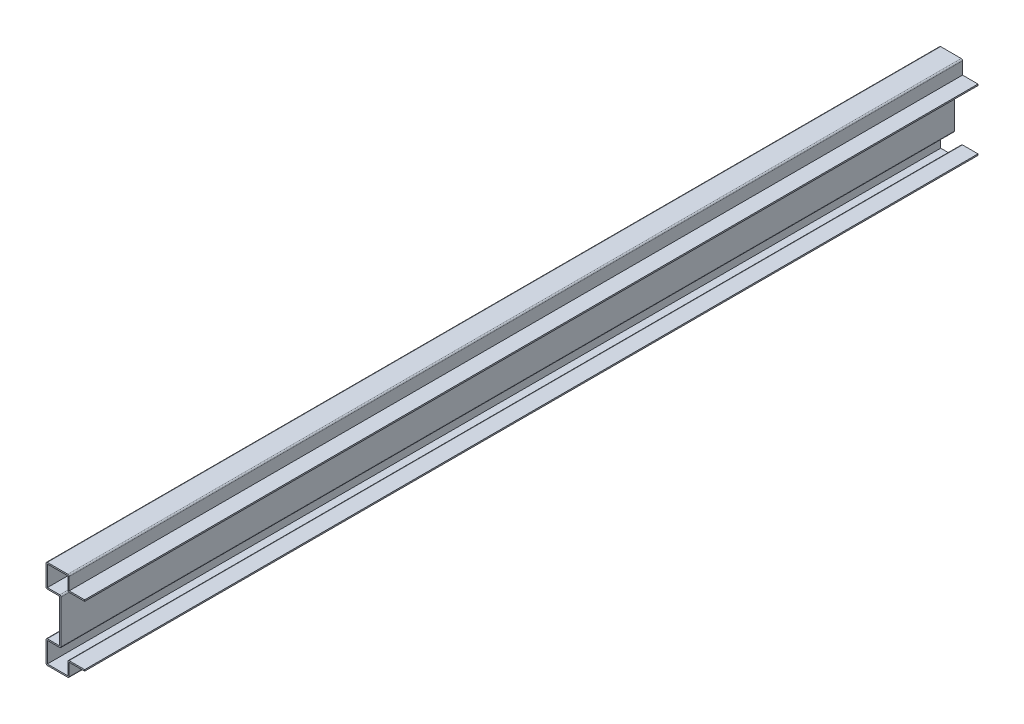
ISO-10303-21;
HEADER;
FILE_DESCRIPTION(('STEP AP214'),'2;1');
FILE_NAME('part.step','',(''),(''),'','','');
FILE_SCHEMA(('AUTOMOTIVE_DESIGN { 1 0 10303 214 1 1 1 1 }'));
ENDSEC;
DATA;
#1=APPLICATION_CONTEXT('core data for automotive mechanical design processes');
#2=APPLICATION_PROTOCOL_DEFINITION('international standard','automotive_design',2000,#1);
#3=PRODUCT_CONTEXT('',#1,'mechanical');
#4=PRODUCT('Part','Part','',(#3));
#5=PRODUCT_RELATED_PRODUCT_CATEGORY('part','',(#4));
#6=PRODUCT_DEFINITION_FORMATION('','',#4);
#7=PRODUCT_DEFINITION_CONTEXT('part definition',#1,'design');
#8=PRODUCT_DEFINITION('design','',#6,#7);
#9=PRODUCT_DEFINITION_SHAPE('','',#8);
#10=(LENGTH_UNIT() NAMED_UNIT(*) SI_UNIT(.MILLI.,.METRE.));
#11=(NAMED_UNIT(*) PLANE_ANGLE_UNIT() SI_UNIT($,.RADIAN.));
#12=(NAMED_UNIT(*) SI_UNIT($,.STERADIAN.) SOLID_ANGLE_UNIT());
#13=UNCERTAINTY_MEASURE_WITH_UNIT(LENGTH_MEASURE(1.E-05),#10,'distance_accuracy_value','');
#14=(GEOMETRIC_REPRESENTATION_CONTEXT(3) GLOBAL_UNCERTAINTY_ASSIGNED_CONTEXT((#13)) GLOBAL_UNIT_ASSIGNED_CONTEXT((#10,
#11,#12)) REPRESENTATION_CONTEXT('',''));
#15=CARTESIAN_POINT('',(0.,0.,0.));
#16=DIRECTION('',(0.,0.,1.));
#17=DIRECTION('',(1.,0.,0.));
#18=AXIS2_PLACEMENT_3D('',#15,#16,#17);
#19=CARTESIAN_POINT('',(0.,12.7,-825.5));
#20=DIRECTION('',(1.,0.,0.));
#21=DIRECTION('',(0.,0.,-1.));
#22=AXIS2_PLACEMENT_3D('',#19,#20,#21);
#23=PLANE('',#22);
#24=DIRECTION('',(0.,1.,0.));
#25=VECTOR('',#24,1.);
#26=CARTESIAN_POINT('',(0.,12.7,0.));
#27=LINE('',#26,#25);
#28=CARTESIAN_POINT('',(0.,12.7,0.));
#29=VERTEX_POINT('',#28);
#30=CARTESIAN_POINT('',(0.,13.97,0.));
#31=VERTEX_POINT('',#30);
#32=EDGE_CURVE('E344',#29,#31,#27,.T.);
#33=ORIENTED_EDGE('',*,*,#32,.F.);
#34=DIRECTION('',(0.,0.,1.));
#35=VECTOR('',#34,1.);
#36=CARTESIAN_POINT('',(0.,12.7,-825.5));
#37=LINE('',#36,#35);
#38=CARTESIAN_POINT('',(0.,12.7,-825.5));
#39=VERTEX_POINT('',#38);
#40=EDGE_CURVE('E279',#39,#29,#37,.T.);
#41=ORIENTED_EDGE('',*,*,#40,.F.);
#42=DIRECTION('',(0.,1.,0.));
#43=VECTOR('',#42,1.);
#44=CARTESIAN_POINT('',(0.,12.7,-825.5));
#45=LINE('',#44,#43);
#46=CARTESIAN_POINT('',(0.,13.97,-825.5));
#47=VERTEX_POINT('',#46);
#48=EDGE_CURVE('E275',#39,#47,#45,.T.);
#49=ORIENTED_EDGE('',*,*,#48,.T.);
#50=DIRECTION('',(0.,0.,1.));
#51=VECTOR('',#50,1.);
#52=CARTESIAN_POINT('',(0.,13.97,-825.5));
#53=LINE('',#52,#51);
#54=EDGE_CURVE('E257',#47,#31,#53,.T.);
#55=ORIENTED_EDGE('',*,*,#54,.T.);
#56=EDGE_LOOP('',(#33,#41,#49,#55));
#57=FACE_BOUND('',#56,.T.);
#58=ADVANCED_FACE('F35',(#57),#23,.T.);
#59=CARTESIAN_POINT('',(0.,12.7,-825.5));
#60=DIRECTION('',(0.,-1.,0.));
#61=DIRECTION('',(1.,0.,0.));
#62=AXIS2_PLACEMENT_3D('',#59,#60,#61);
#63=PLANE('',#62);
#64=DIRECTION('',(1.,0.,0.));
#65=VECTOR('',#64,1.);
#66=CARTESIAN_POINT('',(0.,12.7,0.));
#67=LINE('',#66,#65);
#68=CARTESIAN_POINT('',(-14.2875,12.7,0.));
#69=VERTEX_POINT('',#68);
#70=EDGE_CURVE('E280',#69,#29,#67,.T.);
#71=ORIENTED_EDGE('',*,*,#70,.F.);
#72=DIRECTION('',(0.,0.,1.));
#73=VECTOR('',#72,1.);
#74=CARTESIAN_POINT('',(-14.2875,12.7,-825.5));
#75=LINE('',#74,#73);
#76=CARTESIAN_POINT('',(-14.2875,12.7,-825.5));
#77=VERTEX_POINT('',#76);
#78=EDGE_CURVE('E406',#77,#69,#75,.T.);
#79=ORIENTED_EDGE('',*,*,#78,.F.);
#80=DIRECTION('',(1.,0.,0.));
#81=VECTOR('',#80,1.);
#82=CARTESIAN_POINT('',(0.,12.7,-825.5));
#83=LINE('',#82,#81);
#84=EDGE_CURVE('E269',#77,#39,#83,.T.);
#85=ORIENTED_EDGE('',*,*,#84,.T.);
#86=ORIENTED_EDGE('',*,*,#40,.T.);
#87=EDGE_LOOP('',(#71,#79,#85,#86));
#88=FACE_BOUND('',#87,.T.);
#89=ADVANCED_FACE('F577',(#88),#63,.T.);
#90=CARTESIAN_POINT('',(-14.2875,12.7,-825.5));
#91=DIRECTION('',(1.,0.,0.));
#92=DIRECTION('',(0.,1.,0.));
#93=AXIS2_PLACEMENT_3D('',#90,#91,#92);
#94=PLANE('',#93);
#95=DIRECTION('',(0.,1.,0.));
#96=VECTOR('',#95,1.);
#97=CARTESIAN_POINT('',(-14.2875,12.7,0.));
#98=LINE('',#97,#96);
#99=CARTESIAN_POINT('',(-14.2875,1.27,0.));
#100=VERTEX_POINT('',#99);
#101=EDGE_CURVE('E283',#100,#69,#98,.T.);
#102=ORIENTED_EDGE('',*,*,#101,.F.);
#103=DIRECTION('',(0.,0.,1.));
#104=VECTOR('',#103,1.);
#105=CARTESIAN_POINT('',(-14.2875,1.27,-825.5));
#106=LINE('',#105,#104);
#107=CARTESIAN_POINT('',(-14.2875,1.27,-825.5));
#108=VERTEX_POINT('',#107);
#109=EDGE_CURVE('E488',#100,#108,#106,.F.);
#110=ORIENTED_EDGE('',*,*,#109,.T.);
#111=DIRECTION('',(0.,1.,0.));
#112=VECTOR('',#111,1.);
#113=CARTESIAN_POINT('',(-14.2875,12.7,-825.5));
#114=LINE('',#113,#112);
#115=EDGE_CURVE('E341',#108,#77,#114,.T.);
#116=ORIENTED_EDGE('',*,*,#115,.T.);
#117=ORIENTED_EDGE('',*,*,#78,.T.);
#118=EDGE_LOOP('',(#102,#110,#116,#117));
#119=FACE_BOUND('',#118,.T.);
#120=ADVANCED_FACE('F660',(#119),#94,.T.);
#121=CARTESIAN_POINT('',(-14.2875,0.,-825.5));
#122=DIRECTION('',(0.,-1.,0.));
#123=DIRECTION('',(1.,0.,0.));
#124=AXIS2_PLACEMENT_3D('',#121,#122,#123);
#125=PLANE('',#124);
#126=DIRECTION('',(1.,0.,0.));
#127=VECTOR('',#126,1.);
#128=CARTESIAN_POINT('',(-14.2875,0.,-825.5));
#129=LINE('',#128,#127);
#130=CARTESIAN_POINT('',(-34.44875,0.,-825.5));
#131=VERTEX_POINT('',#130);
#132=CARTESIAN_POINT('',(-15.5575,0.,-825.5));
#133=VERTEX_POINT('',#132);
#134=EDGE_CURVE('E338',#131,#133,#129,.T.);
#135=ORIENTED_EDGE('',*,*,#134,.T.);
#136=DIRECTION('',(0.,0.,1.));
#137=VECTOR('',#136,1.);
#138=CARTESIAN_POINT('',(-15.5575,0.,-825.5));
#139=LINE('',#138,#137);
#140=CARTESIAN_POINT('',(-15.5575,0.,0.));
#141=VERTEX_POINT('',#140);
#142=EDGE_CURVE('E485',#133,#141,#139,.T.);
#143=ORIENTED_EDGE('',*,*,#142,.T.);
#144=DIRECTION('',(1.,0.,0.));
#145=VECTOR('',#144,1.);
#146=CARTESIAN_POINT('',(-14.2875,0.,0.));
#147=LINE('',#146,#145);
#148=CARTESIAN_POINT('',(-34.44875,0.,0.));
#149=VERTEX_POINT('',#148);
#150=EDGE_CURVE('E400',#149,#141,#147,.T.);
#151=ORIENTED_EDGE('',*,*,#150,.F.);
#152=DIRECTION('',(0.,0.,1.));
#153=VECTOR('',#152,1.);
#154=CARTESIAN_POINT('',(-34.44875,0.,-825.5));
#155=LINE('',#154,#153);
#156=EDGE_CURVE('E483',#149,#131,#155,.F.);
#157=ORIENTED_EDGE('',*,*,#156,.T.);
#158=EDGE_LOOP('',(#135,#143,#151,#157));
#159=FACE_BOUND('',#158,.T.);
#160=ADVANCED_FACE('F588',(#159),#125,.T.);
#161=CARTESIAN_POINT('',(-35.71875,0.,-825.5));
#162=DIRECTION('',(-1.,0.,0.));
#163=DIRECTION('',(0.,0.,1.));
#164=AXIS2_PLACEMENT_3D('',#161,#162,#163);
#165=PLANE('',#164);
#166=DIRECTION('',(0.,-1.,0.));
#167=VECTOR('',#166,1.);
#168=CARTESIAN_POINT('',(-35.71875,0.,-825.5));
#169=LINE('',#168,#167);
#170=CARTESIAN_POINT('',(-35.71875,20.16125,-825.5));
#171=VERTEX_POINT('',#170);
#172=CARTESIAN_POINT('',(-35.71875,1.27,-825.5));
#173=VERTEX_POINT('',#172);
#174=EDGE_CURVE('E335',#171,#173,#169,.T.);
#175=ORIENTED_EDGE('',*,*,#174,.T.);
#176=DIRECTION('',(0.,0.,1.));
#177=VECTOR('',#176,1.);
#178=CARTESIAN_POINT('',(-35.71875,1.27,-825.5));
#179=LINE('',#178,#177);
#180=CARTESIAN_POINT('',(-35.71875,1.27,0.));
#181=VERTEX_POINT('',#180);
#182=EDGE_CURVE('E492',#173,#181,#179,.T.);
#183=ORIENTED_EDGE('',*,*,#182,.T.);
#184=DIRECTION('',(0.,-1.,0.));
#185=VECTOR('',#184,1.);
#186=CARTESIAN_POINT('',(-35.71875,0.,0.));
#187=LINE('',#186,#185);
#188=CARTESIAN_POINT('',(-35.71875,20.16125,0.));
#189=VERTEX_POINT('',#188);
#190=EDGE_CURVE('E397',#189,#181,#187,.T.);
#191=ORIENTED_EDGE('',*,*,#190,.F.);
#192=DIRECTION('',(0.,0.,1.));
#193=VECTOR('',#192,1.);
#194=CARTESIAN_POINT('',(-35.71875,20.16125,-825.5));
#195=LINE('',#194,#193);
#196=EDGE_CURVE('E490',#189,#171,#195,.F.);
#197=ORIENTED_EDGE('',*,*,#196,.T.);
#198=EDGE_LOOP('',(#175,#183,#191,#197));
#199=FACE_BOUND('',#198,.T.);
#200=ADVANCED_FACE('F596',(#199),#165,.T.);
#201=CARTESIAN_POINT('',(-35.71875,21.43125,-825.5));
#202=DIRECTION('',(0.,1.,0.));
#203=DIRECTION('',(0.,0.,1.));
#204=AXIS2_PLACEMENT_3D('',#201,#202,#203);
#205=PLANE('',#204);
#206=DIRECTION('',(-1.,0.,0.));
#207=VECTOR('',#206,1.);
#208=CARTESIAN_POINT('',(-35.71875,21.43125,-825.5));
#209=LINE('',#208,#207);
#210=CARTESIAN_POINT('',(-23.01875,21.43125,-825.5));
#211=VERTEX_POINT('',#210);
#212=CARTESIAN_POINT('',(-34.44875,21.43125,-825.5));
#213=VERTEX_POINT('',#212);
#214=EDGE_CURVE('E332',#211,#213,#209,.T.);
#215=ORIENTED_EDGE('',*,*,#214,.T.);
#216=DIRECTION('',(0.,0.,1.));
#217=VECTOR('',#216,1.);
#218=CARTESIAN_POINT('',(-34.44875,21.43125,-825.5));
#219=LINE('',#218,#217);
#220=CARTESIAN_POINT('',(-34.44875,21.43125,0.));
#221=VERTEX_POINT('',#220);
#222=EDGE_CURVE('E495',#213,#221,#219,.T.);
#223=ORIENTED_EDGE('',*,*,#222,.T.);
#224=DIRECTION('',(-1.,0.,0.));
#225=VECTOR('',#224,1.);
#226=CARTESIAN_POINT('',(-35.71875,21.43125,0.));
#227=LINE('',#226,#225);
#228=CARTESIAN_POINT('',(-23.01875,21.43125,0.));
#229=VERTEX_POINT('',#228);
#230=EDGE_CURVE('E394',#229,#221,#227,.T.);
#231=ORIENTED_EDGE('',*,*,#230,.F.);
#232=DIRECTION('',(0.,0.,1.));
#233=VECTOR('',#232,1.);
#234=CARTESIAN_POINT('',(-23.01875,21.43125,-825.5));
#235=LINE('',#234,#233);
#236=EDGE_CURVE('E409',#211,#229,#235,.T.);
#237=ORIENTED_EDGE('',*,*,#236,.F.);
#238=EDGE_LOOP('',(#215,#223,#231,#237));
#239=FACE_BOUND('',#238,.T.);
#240=ADVANCED_FACE('F606',(#239),#205,.T.);
#241=CARTESIAN_POINT('',(-23.01875,21.43125,-825.5));
#242=DIRECTION('',(-1.,0.,0.));
#243=DIRECTION('',(0.,0.,1.));
#244=AXIS2_PLACEMENT_3D('',#241,#242,#243);
#245=PLANE('',#244);
#246=DIRECTION('',(0.,-1.,0.));
#247=VECTOR('',#246,1.);
#248=CARTESIAN_POINT('',(-23.01875,21.43125,0.));
#249=LINE('',#248,#247);
#250=CARTESIAN_POINT('',(-23.01875,61.11875,0.));
#251=VERTEX_POINT('',#250);
#252=EDGE_CURVE('E391',#251,#229,#249,.T.);
#253=ORIENTED_EDGE('',*,*,#252,.F.);
#254=DIRECTION('',(0.,0.,1.));
#255=VECTOR('',#254,1.);
#256=CARTESIAN_POINT('',(-23.01875,61.11875,-825.5));
#257=LINE('',#256,#255);
#258=CARTESIAN_POINT('',(-23.01875,61.11875,-825.5));
#259=VERTEX_POINT('',#258);
#260=EDGE_CURVE('E411',#259,#251,#257,.T.);
#261=ORIENTED_EDGE('',*,*,#260,.F.);
#262=DIRECTION('',(0.,-1.,0.));
#263=VECTOR('',#262,1.);
#264=CARTESIAN_POINT('',(-23.01875,21.43125,-825.5));
#265=LINE('',#264,#263);
#266=EDGE_CURVE('E329',#259,#211,#265,.T.);
#267=ORIENTED_EDGE('',*,*,#266,.T.);
#268=ORIENTED_EDGE('',*,*,#236,.T.);
#269=EDGE_LOOP('',(#253,#261,#267,#268));
#270=FACE_BOUND('',#269,.T.);
#271=ADVANCED_FACE('F611',(#270),#245,.T.);
#272=CARTESIAN_POINT('',(-35.71875,61.11875,-825.5));
#273=DIRECTION('',(0.,-1.,0.));
#274=DIRECTION('',(0.,0.,-1.));
#275=AXIS2_PLACEMENT_3D('',#272,#273,#274);
#276=PLANE('',#275);
#277=DIRECTION('',(1.,0.,0.));
#278=VECTOR('',#277,1.);
#279=CARTESIAN_POINT('',(-35.71875,61.11875,0.));
#280=LINE('',#279,#278);
#281=CARTESIAN_POINT('',(-34.44875,61.11875,0.));
#282=VERTEX_POINT('',#281);
#283=EDGE_CURVE('E389',#282,#251,#280,.T.);
#284=ORIENTED_EDGE('',*,*,#283,.F.);
#285=DIRECTION('',(0.,0.,1.));
#286=VECTOR('',#285,1.);
#287=CARTESIAN_POINT('',(-34.44875,61.11875,-825.5));
#288=LINE('',#287,#286);
#289=CARTESIAN_POINT('',(-34.44875,61.11875,-825.5));
#290=VERTEX_POINT('',#289);
#291=EDGE_CURVE('E505',#282,#290,#288,.F.);
#292=ORIENTED_EDGE('',*,*,#291,.T.);
#293=DIRECTION('',(1.,0.,0.));
#294=VECTOR('',#293,1.);
#295=CARTESIAN_POINT('',(-35.71875,61.11875,-825.5));
#296=LINE('',#295,#294);
#297=EDGE_CURVE('E327',#290,#259,#296,.T.);
#298=ORIENTED_EDGE('',*,*,#297,.T.);
#299=ORIENTED_EDGE('',*,*,#260,.T.);
#300=EDGE_LOOP('',(#284,#292,#298,#299));
#301=FACE_BOUND('',#300,.T.);
#302=ADVANCED_FACE('F843',(#301),#276,.T.);
#303=CARTESIAN_POINT('',(-35.71875,82.55,-825.5));
#304=DIRECTION('',(-1.,0.,0.));
#305=DIRECTION('',(0.,0.,1.));
#306=AXIS2_PLACEMENT_3D('',#303,#304,#305);
#307=PLANE('',#306);
#308=DIRECTION('',(0.,-1.,0.));
#309=VECTOR('',#308,1.);
#310=CARTESIAN_POINT('',(-35.71875,82.55,-825.5));
#311=LINE('',#310,#309);
#312=CARTESIAN_POINT('',(-35.71875,81.28,-825.5));
#313=VERTEX_POINT('',#312);
#314=CARTESIAN_POINT('',(-35.71875,62.38875,-825.5));
#315=VERTEX_POINT('',#314);
#316=EDGE_CURVE('E324',#313,#315,#311,.T.);
#317=ORIENTED_EDGE('',*,*,#316,.T.);
#318=DIRECTION('',(0.,0.,1.));
#319=VECTOR('',#318,1.);
#320=CARTESIAN_POINT('',(-35.71875,62.38875,-825.5));
#321=LINE('',#320,#319);
#322=CARTESIAN_POINT('',(-35.71875,62.38875,0.));
#323=VERTEX_POINT('',#322);
#324=EDGE_CURVE('E502',#315,#323,#321,.T.);
#325=ORIENTED_EDGE('',*,*,#324,.T.);
#326=DIRECTION('',(0.,-1.,0.));
#327=VECTOR('',#326,1.);
#328=CARTESIAN_POINT('',(-35.71875,82.55,0.));
#329=LINE('',#328,#327);
#330=CARTESIAN_POINT('',(-35.71875,81.28,0.));
#331=VERTEX_POINT('',#330);
#332=EDGE_CURVE('E386',#331,#323,#329,.T.);
#333=ORIENTED_EDGE('',*,*,#332,.F.);
#334=DIRECTION('',(0.,0.,1.));
#335=VECTOR('',#334,1.);
#336=CARTESIAN_POINT('',(-35.71875,81.28,-825.5));
#337=LINE('',#336,#335);
#338=EDGE_CURVE('E500',#331,#313,#337,.F.);
#339=ORIENTED_EDGE('',*,*,#338,.T.);
#340=EDGE_LOOP('',(#317,#325,#333,#339));
#341=FACE_BOUND('',#340,.T.);
#342=ADVANCED_FACE('F623',(#341),#307,.T.);
#343=CARTESIAN_POINT('',(-14.2875,82.55,-825.5));
#344=DIRECTION('',(0.,1.,0.));
#345=DIRECTION('',(0.,0.,1.));
#346=AXIS2_PLACEMENT_3D('',#343,#344,#345);
#347=PLANE('',#346);
#348=DIRECTION('',(-1.,0.,0.));
#349=VECTOR('',#348,1.);
#350=CARTESIAN_POINT('',(-14.2875,82.55,-825.5));
#351=LINE('',#350,#349);
#352=CARTESIAN_POINT('',(-15.5575,82.55,-825.5));
#353=VERTEX_POINT('',#352);
#354=CARTESIAN_POINT('',(-34.44875,82.55,-825.5));
#355=VERTEX_POINT('',#354);
#356=EDGE_CURVE('E321',#353,#355,#351,.T.);
#357=ORIENTED_EDGE('',*,*,#356,.T.);
#358=DIRECTION('',(0.,0.,1.));
#359=VECTOR('',#358,1.);
#360=CARTESIAN_POINT('',(-34.44875,82.55,-825.5));
#361=LINE('',#360,#359);
#362=CARTESIAN_POINT('',(-34.44875,82.55,0.));
#363=VERTEX_POINT('',#362);
#364=EDGE_CURVE('E509',#355,#363,#361,.T.);
#365=ORIENTED_EDGE('',*,*,#364,.T.);
#366=DIRECTION('',(-1.,0.,0.));
#367=VECTOR('',#366,1.);
#368=CARTESIAN_POINT('',(-14.2875,82.55,0.));
#369=LINE('',#368,#367);
#370=CARTESIAN_POINT('',(-15.5575,82.55,0.));
#371=VERTEX_POINT('',#370);
#372=EDGE_CURVE('E383',#371,#363,#369,.T.);
#373=ORIENTED_EDGE('',*,*,#372,.F.);
#374=DIRECTION('',(0.,0.,1.));
#375=VECTOR('',#374,1.);
#376=CARTESIAN_POINT('',(-15.5575,82.55,-825.5));
#377=LINE('',#376,#375);
#378=EDGE_CURVE('E507',#371,#353,#377,.F.);
#379=ORIENTED_EDGE('',*,*,#378,.T.);
#380=EDGE_LOOP('',(#357,#365,#373,#379));
#381=FACE_BOUND('',#380,.T.);
#382=ADVANCED_FACE('F631',(#381),#347,.T.);
#383=CARTESIAN_POINT('',(-14.2875,69.85,-825.5));
#384=DIRECTION('',(1.,0.,0.));
#385=DIRECTION('',(0.,1.,0.));
#386=AXIS2_PLACEMENT_3D('',#383,#384,#385);
#387=PLANE('',#386);
#388=DIRECTION('',(0.,1.,0.));
#389=VECTOR('',#388,1.);
#390=CARTESIAN_POINT('',(-14.2875,69.85,-825.5));
#391=LINE('',#390,#389);
#392=CARTESIAN_POINT('',(-14.2875,69.85,-825.5));
#393=VERTEX_POINT('',#392);
#394=CARTESIAN_POINT('',(-14.2875,81.28,-825.5));
#395=VERTEX_POINT('',#394);
#396=EDGE_CURVE('E318',#393,#395,#391,.T.);
#397=ORIENTED_EDGE('',*,*,#396,.T.);
#398=DIRECTION('',(0.,0.,1.));
#399=VECTOR('',#398,1.);
#400=CARTESIAN_POINT('',(-14.2875,81.28,-825.5));
#401=LINE('',#400,#399);
#402=CARTESIAN_POINT('',(-14.2875,81.28,0.));
#403=VERTEX_POINT('',#402);
#404=EDGE_CURVE('E11',#395,#403,#401,.T.);
#405=ORIENTED_EDGE('',*,*,#404,.T.);
#406=DIRECTION('',(0.,1.,0.));
#407=VECTOR('',#406,1.);
#408=CARTESIAN_POINT('',(-14.2875,69.85,0.));
#409=LINE('',#408,#407);
#410=CARTESIAN_POINT('',(-14.2875,69.85,0.));
#411=VERTEX_POINT('',#410);
#412=EDGE_CURVE('E380',#411,#403,#409,.T.);
#413=ORIENTED_EDGE('',*,*,#412,.F.);
#414=DIRECTION('',(0.,0.,1.));
#415=VECTOR('',#414,1.);
#416=CARTESIAN_POINT('',(-14.2875,69.85,-825.5));
#417=LINE('',#416,#415);
#418=EDGE_CURVE('E414',#393,#411,#417,.T.);
#419=ORIENTED_EDGE('',*,*,#418,.F.);
#420=EDGE_LOOP('',(#397,#405,#413,#419));
#421=FACE_BOUND('',#420,.T.);
#422=ADVANCED_FACE('F640',(#421),#387,.T.);
#423=CARTESIAN_POINT('',(0.,69.85,-825.5));
#424=DIRECTION('',(0.,1.,0.));
#425=DIRECTION('',(0.,0.,1.));
#426=AXIS2_PLACEMENT_3D('',#423,#424,#425);
#427=PLANE('',#426);
#428=DIRECTION('',(-1.,0.,0.));
#429=VECTOR('',#428,1.);
#430=CARTESIAN_POINT('',(0.,69.85,0.));
#431=LINE('',#430,#429);
#432=CARTESIAN_POINT('',(0.,69.85,0.));
#433=VERTEX_POINT('',#432);
#434=EDGE_CURVE('E377',#433,#411,#431,.T.);
#435=ORIENTED_EDGE('',*,*,#434,.F.);
#436=DIRECTION('',(0.,0.,1.));
#437=VECTOR('',#436,1.);
#438=CARTESIAN_POINT('',(0.,69.85,-825.5));
#439=LINE('',#438,#437);
#440=CARTESIAN_POINT('',(0.,69.85,-825.5));
#441=VERTEX_POINT('',#440);
#442=EDGE_CURVE('E416',#441,#433,#439,.T.);
#443=ORIENTED_EDGE('',*,*,#442,.F.);
#444=DIRECTION('',(-1.,0.,0.));
#445=VECTOR('',#444,1.);
#446=CARTESIAN_POINT('',(0.,69.85,-825.5));
#447=LINE('',#446,#445);
#448=EDGE_CURVE('E315',#441,#393,#447,.T.);
#449=ORIENTED_EDGE('',*,*,#448,.T.);
#450=ORIENTED_EDGE('',*,*,#418,.T.);
#451=EDGE_LOOP('',(#435,#443,#449,#450));
#452=FACE_BOUND('',#451,.T.);
#453=ADVANCED_FACE('F644',(#452),#427,.T.);
#454=CARTESIAN_POINT('',(0.,69.85,-825.5));
#455=DIRECTION('',(1.,0.,0.));
#456=DIRECTION('',(0.,0.,-1.));
#457=AXIS2_PLACEMENT_3D('',#454,#455,#456);
#458=PLANE('',#457);
#459=DIRECTION('',(0.,1.,0.));
#460=VECTOR('',#459,1.);
#461=CARTESIAN_POINT('',(0.,69.85,0.));
#462=LINE('',#461,#460);
#463=CARTESIAN_POINT('',(0.,68.58,0.));
#464=VERTEX_POINT('',#463);
#465=EDGE_CURVE('E374',#464,#433,#462,.T.);
#466=ORIENTED_EDGE('',*,*,#465,.F.);
#467=DIRECTION('',(0.,0.,1.));
#468=VECTOR('',#467,1.);
#469=CARTESIAN_POINT('',(0.,68.58,-825.5));
#470=LINE('',#469,#468);
#471=CARTESIAN_POINT('',(0.,68.58,-825.5));
#472=VERTEX_POINT('',#471);
#473=EDGE_CURVE('E418',#472,#464,#470,.T.);
#474=ORIENTED_EDGE('',*,*,#473,.F.);
#475=DIRECTION('',(0.,1.,0.));
#476=VECTOR('',#475,1.);
#477=CARTESIAN_POINT('',(0.,69.85,-825.5));
#478=LINE('',#477,#476);
#479=EDGE_CURVE('E312',#472,#441,#478,.T.);
#480=ORIENTED_EDGE('',*,*,#479,.T.);
#481=ORIENTED_EDGE('',*,*,#442,.T.);
#482=EDGE_LOOP('',(#466,#474,#480,#481));
#483=FACE_BOUND('',#482,.T.);
#484=ADVANCED_FACE('F646',(#483),#458,.T.);
#485=CARTESIAN_POINT('',(0.,68.58,-825.5));
#486=DIRECTION('',(0.,-1.,0.));
#487=DIRECTION('',(0.,0.,-1.));
#488=AXIS2_PLACEMENT_3D('',#485,#486,#487);
#489=PLANE('',#488);
#490=DIRECTION('',(1.,0.,0.));
#491=VECTOR('',#490,1.);
#492=CARTESIAN_POINT('',(0.,68.58,0.));
#493=LINE('',#492,#491);
#494=CARTESIAN_POINT('',(-14.2875,68.58,0.));
#495=VERTEX_POINT('',#494);
#496=EDGE_CURVE('E372',#495,#464,#493,.T.);
#497=ORIENTED_EDGE('',*,*,#496,.F.);
#498=DIRECTION('',(0.,0.,1.));
#499=VECTOR('',#498,1.);
#500=CARTESIAN_POINT('',(-14.2875,68.58,-825.5));
#501=LINE('',#500,#499);
#502=CARTESIAN_POINT('',(-14.2875,68.58,-825.5));
#503=VERTEX_POINT('',#502);
#504=EDGE_CURVE('E43',#495,#503,#501,.F.);
#505=ORIENTED_EDGE('',*,*,#504,.T.);
#506=DIRECTION('',(1.,0.,0.));
#507=VECTOR('',#506,1.);
#508=CARTESIAN_POINT('',(0.,68.58,-825.5));
#509=LINE('',#508,#507);
#510=EDGE_CURVE('E310',#503,#472,#509,.T.);
#511=ORIENTED_EDGE('',*,*,#510,.T.);
#512=ORIENTED_EDGE('',*,*,#473,.T.);
#513=EDGE_LOOP('',(#497,#505,#511,#512));
#514=FACE_BOUND('',#513,.T.);
#515=ADVANCED_FACE('F518',(#514),#489,.T.);
#516=CARTESIAN_POINT('',(-15.5575,68.58,-825.5));
#517=DIRECTION('',(-1.,0.,0.));
#518=DIRECTION('',(0.,0.,1.));
#519=AXIS2_PLACEMENT_3D('',#516,#517,#518);
#520=PLANE('',#519);
#521=DIRECTION('',(0.,-1.,0.));
#522=VECTOR('',#521,1.);
#523=CARTESIAN_POINT('',(-15.5575,68.58,-825.5));
#524=LINE('',#523,#522);
#525=CARTESIAN_POINT('',(-15.5575,81.28,-825.5));
#526=VERTEX_POINT('',#525);
#527=CARTESIAN_POINT('',(-15.5575,69.85,-825.5));
#528=VERTEX_POINT('',#527);
#529=EDGE_CURVE('E307',#526,#528,#524,.T.);
#530=ORIENTED_EDGE('',*,*,#529,.T.);
#531=DIRECTION('',(0.,0.,1.));
#532=VECTOR('',#531,1.);
#533=CARTESIAN_POINT('',(-15.5575,69.85,-825.5));
#534=LINE('',#533,#532);
#535=CARTESIAN_POINT('',(-15.5575,69.85,0.));
#536=VERTEX_POINT('',#535);
#537=EDGE_CURVE('E512',#528,#536,#534,.T.);
#538=ORIENTED_EDGE('',*,*,#537,.T.);
#539=DIRECTION('',(0.,-1.,0.));
#540=VECTOR('',#539,1.);
#541=CARTESIAN_POINT('',(-15.5575,68.58,0.));
#542=LINE('',#541,#540);
#543=CARTESIAN_POINT('',(-15.5575,81.28,0.));
#544=VERTEX_POINT('',#543);
#545=EDGE_CURVE('E369',#544,#536,#542,.T.);
#546=ORIENTED_EDGE('',*,*,#545,.F.);
#547=DIRECTION('',(0.,0.,1.));
#548=VECTOR('',#547,1.);
#549=CARTESIAN_POINT('',(-15.5575,81.28,-825.5));
#550=LINE('',#549,#548);
#551=EDGE_CURVE('E421',#526,#544,#550,.T.);
#552=ORIENTED_EDGE('',*,*,#551,.F.);
#553=EDGE_LOOP('',(#530,#538,#546,#552));
#554=FACE_BOUND('',#553,.T.);
#555=ADVANCED_FACE('F529',(#554),#520,.T.);
#556=CARTESIAN_POINT('',(-15.5575,81.28,-825.5));
#557=DIRECTION('',(0.,-1.,0.));
#558=DIRECTION('',(0.,0.,-1.));
#559=AXIS2_PLACEMENT_3D('',#556,#557,#558);
#560=PLANE('',#559);
#561=DIRECTION('',(1.,0.,0.));
#562=VECTOR('',#561,1.);
#563=CARTESIAN_POINT('',(-15.5575,81.28,0.));
#564=LINE('',#563,#562);
#565=CARTESIAN_POINT('',(-34.44875,81.28,0.));
#566=VERTEX_POINT('',#565);
#567=EDGE_CURVE('E366',#566,#544,#564,.T.);
#568=ORIENTED_EDGE('',*,*,#567,.F.);
#569=DIRECTION('',(0.,0.,1.));
#570=VECTOR('',#569,1.);
#571=CARTESIAN_POINT('',(-34.44875,81.28,-825.5));
#572=LINE('',#571,#570);
#573=CARTESIAN_POINT('',(-34.44875,81.28,-825.5));
#574=VERTEX_POINT('',#573);
#575=EDGE_CURVE('E423',#574,#566,#572,.T.);
#576=ORIENTED_EDGE('',*,*,#575,.F.);
#577=DIRECTION('',(1.,0.,0.));
#578=VECTOR('',#577,1.);
#579=CARTESIAN_POINT('',(-15.5575,81.28,-825.5));
#580=LINE('',#579,#578);
#581=EDGE_CURVE('E304',#574,#526,#580,.T.);
#582=ORIENTED_EDGE('',*,*,#581,.T.);
#583=ORIENTED_EDGE('',*,*,#551,.T.);
#584=EDGE_LOOP('',(#568,#576,#582,#583));
#585=FACE_BOUND('',#584,.T.);
#586=ADVANCED_FACE('F535',(#585),#560,.T.);
#587=CARTESIAN_POINT('',(-34.44875,81.28,-825.5));
#588=DIRECTION('',(1.,0.,0.));
#589=DIRECTION('',(0.,0.,-1.));
#590=AXIS2_PLACEMENT_3D('',#587,#588,#589);
#591=PLANE('',#590);
#592=DIRECTION('',(0.,1.,0.));
#593=VECTOR('',#592,1.);
#594=CARTESIAN_POINT('',(-34.44875,81.28,0.));
#595=LINE('',#594,#593);
#596=CARTESIAN_POINT('',(-34.44875,62.38875,0.));
#597=VERTEX_POINT('',#596);
#598=EDGE_CURVE('E363',#597,#566,#595,.T.);
#599=ORIENTED_EDGE('',*,*,#598,.F.);
#600=DIRECTION('',(0.,0.,1.));
#601=VECTOR('',#600,1.);
#602=CARTESIAN_POINT('',(-34.44875,62.38875,-825.5));
#603=LINE('',#602,#601);
#604=CARTESIAN_POINT('',(-34.44875,62.38875,-825.5));
#605=VERTEX_POINT('',#604);
#606=EDGE_CURVE('E425',#605,#597,#603,.T.);
#607=ORIENTED_EDGE('',*,*,#606,.F.);
#608=DIRECTION('',(0.,1.,0.));
#609=VECTOR('',#608,1.);
#610=CARTESIAN_POINT('',(-34.44875,81.28,-825.5));
#611=LINE('',#610,#609);
#612=EDGE_CURVE('E301',#605,#574,#611,.T.);
#613=ORIENTED_EDGE('',*,*,#612,.T.);
#614=ORIENTED_EDGE('',*,*,#575,.T.);
#615=EDGE_LOOP('',(#599,#607,#613,#614));
#616=FACE_BOUND('',#615,.T.);
#617=ADVANCED_FACE('F541',(#616),#591,.T.);
#618=CARTESIAN_POINT('',(-34.44875,62.38875,-825.5));
#619=DIRECTION('',(0.,1.,0.));
#620=DIRECTION('',(-1.,0.,0.));
#621=AXIS2_PLACEMENT_3D('',#618,#619,#620);
#622=PLANE('',#621);
#623=DIRECTION('',(-1.,0.,0.));
#624=VECTOR('',#623,1.);
#625=CARTESIAN_POINT('',(-34.44875,62.38875,0.));
#626=LINE('',#625,#624);
#627=CARTESIAN_POINT('',(-23.01875,62.38875,0.));
#628=VERTEX_POINT('',#627);
#629=EDGE_CURVE('E361',#628,#597,#626,.T.);
#630=ORIENTED_EDGE('',*,*,#629,.F.);
#631=DIRECTION('',(0.,0.,1.));
#632=VECTOR('',#631,1.);
#633=CARTESIAN_POINT('',(-23.01875,62.38875,-825.5));
#634=LINE('',#633,#632);
#635=CARTESIAN_POINT('',(-23.01875,62.38875,-825.5));
#636=VERTEX_POINT('',#635);
#637=EDGE_CURVE('E498',#628,#636,#634,.F.);
#638=ORIENTED_EDGE('',*,*,#637,.T.);
#639=DIRECTION('',(-1.,0.,0.));
#640=VECTOR('',#639,1.);
#641=CARTESIAN_POINT('',(-34.44875,62.38875,-825.5));
#642=LINE('',#641,#640);
#643=EDGE_CURVE('E299',#636,#605,#642,.T.);
#644=ORIENTED_EDGE('',*,*,#643,.T.);
#645=ORIENTED_EDGE('',*,*,#606,.T.);
#646=EDGE_LOOP('',(#630,#638,#644,#645));
#647=FACE_BOUND('',#646,.T.);
#648=ADVANCED_FACE('F544',(#647),#622,.T.);
#649=CARTESIAN_POINT('',(-21.74875,20.16125,-825.5));
#650=DIRECTION('',(1.,0.,0.));
#651=DIRECTION('',(0.,0.,-1.));
#652=AXIS2_PLACEMENT_3D('',#649,#650,#651);
#653=PLANE('',#652);
#654=DIRECTION('',(0.,1.,0.));
#655=VECTOR('',#654,1.);
#656=CARTESIAN_POINT('',(-21.74875,20.16125,0.));
#657=LINE('',#656,#655);
#658=CARTESIAN_POINT('',(-21.74875,21.43125,0.));
#659=VERTEX_POINT('',#658);
#660=CARTESIAN_POINT('',(-21.74875,61.11875,0.));
#661=VERTEX_POINT('',#660);
#662=EDGE_CURVE('E358',#659,#661,#657,.T.);
#663=ORIENTED_EDGE('',*,*,#662,.F.);
#664=DIRECTION('',(0.,0.,1.));
#665=VECTOR('',#664,1.);
#666=CARTESIAN_POINT('',(-21.74875,21.43125,-825.5));
#667=LINE('',#666,#665);
#668=CARTESIAN_POINT('',(-21.74875,21.43125,-825.5));
#669=VERTEX_POINT('',#668);
#670=EDGE_CURVE('E459',#659,#669,#667,.F.);
#671=ORIENTED_EDGE('',*,*,#670,.T.);
#672=DIRECTION('',(0.,1.,0.));
#673=VECTOR('',#672,1.);
#674=CARTESIAN_POINT('',(-21.74875,20.16125,-825.5));
#675=LINE('',#674,#673);
#676=CARTESIAN_POINT('',(-21.74875,61.11875,-825.5));
#677=VERTEX_POINT('',#676);
#678=EDGE_CURVE('E296',#669,#677,#675,.T.);
#679=ORIENTED_EDGE('',*,*,#678,.T.);
#680=DIRECTION('',(0.,0.,1.));
#681=VECTOR('',#680,1.);
#682=CARTESIAN_POINT('',(-21.74875,61.11875,-825.5));
#683=LINE('',#682,#681);
#684=EDGE_CURVE('E456',#677,#661,#683,.T.);
#685=ORIENTED_EDGE('',*,*,#684,.T.);
#686=EDGE_LOOP('',(#663,#671,#679,#685));
#687=FACE_BOUND('',#686,.T.);
#688=ADVANCED_FACE('F552',(#687),#653,.T.);
#689=CARTESIAN_POINT('',(-34.44875,20.16125,-825.5));
#690=DIRECTION('',(0.,-1.,0.));
#691=DIRECTION('',(0.,0.,-1.));
#692=AXIS2_PLACEMENT_3D('',#689,#690,#691);
#693=PLANE('',#692);
#694=DIRECTION('',(1.,0.,0.));
#695=VECTOR('',#694,1.);
#696=CARTESIAN_POINT('',(-34.44875,20.16125,-825.5));
#697=LINE('',#696,#695);
#698=CARTESIAN_POINT('',(-34.44875,20.16125,-825.5));
#699=VERTEX_POINT('',#698);
#700=CARTESIAN_POINT('',(-23.01875,20.16125,-825.5));
#701=VERTEX_POINT('',#700);
#702=EDGE_CURVE('E293',#699,#701,#697,.T.);
#703=ORIENTED_EDGE('',*,*,#702,.T.);
#704=DIRECTION('',(0.,0.,1.));
#705=VECTOR('',#704,1.);
#706=CARTESIAN_POINT('',(-23.01875,20.16125,-825.5));
#707=LINE('',#706,#705);
#708=CARTESIAN_POINT('',(-23.01875,20.16125,0.));
#709=VERTEX_POINT('',#708);
#710=EDGE_CURVE('E405',#701,#709,#707,.T.);
#711=ORIENTED_EDGE('',*,*,#710,.T.);
#712=DIRECTION('',(1.,0.,0.));
#713=VECTOR('',#712,1.);
#714=CARTESIAN_POINT('',(-34.44875,20.16125,0.));
#715=LINE('',#714,#713);
#716=CARTESIAN_POINT('',(-34.44875,20.16125,0.));
#717=VERTEX_POINT('',#716);
#718=EDGE_CURVE('E355',#717,#709,#715,.T.);
#719=ORIENTED_EDGE('',*,*,#718,.F.);
#720=DIRECTION('',(0.,0.,1.));
#721=VECTOR('',#720,1.);
#722=CARTESIAN_POINT('',(-34.44875,20.16125,-825.5));
#723=LINE('',#722,#721);
#724=EDGE_CURVE('E428',#699,#717,#723,.T.);
#725=ORIENTED_EDGE('',*,*,#724,.F.);
#726=EDGE_LOOP('',(#703,#711,#719,#725));
#727=FACE_BOUND('',#726,.T.);
#728=ADVANCED_FACE('F560',(#727),#693,.T.);
#729=CARTESIAN_POINT('',(-34.44875,1.27,-825.5));
#730=DIRECTION('',(1.,0.,0.));
#731=DIRECTION('',(0.,0.,-1.));
#732=AXIS2_PLACEMENT_3D('',#729,#730,#731);
#733=PLANE('',#732);
#734=DIRECTION('',(0.,1.,0.));
#735=VECTOR('',#734,1.);
#736=CARTESIAN_POINT('',(-34.44875,1.27,0.));
#737=LINE('',#736,#735);
#738=CARTESIAN_POINT('',(-34.44875,1.27,0.));
#739=VERTEX_POINT('',#738);
#740=EDGE_CURVE('E352',#739,#717,#737,.T.);
#741=ORIENTED_EDGE('',*,*,#740,.F.);
#742=DIRECTION('',(0.,0.,1.));
#743=VECTOR('',#742,1.);
#744=CARTESIAN_POINT('',(-34.44875,1.27,-825.5));
#745=LINE('',#744,#743);
#746=CARTESIAN_POINT('',(-34.44875,1.27,-825.5));
#747=VERTEX_POINT('',#746);
#748=EDGE_CURVE('E430',#747,#739,#745,.T.);
#749=ORIENTED_EDGE('',*,*,#748,.F.);
#750=DIRECTION('',(0.,1.,0.));
#751=VECTOR('',#750,1.);
#752=CARTESIAN_POINT('',(-34.44875,1.27,-825.5));
#753=LINE('',#752,#751);
#754=EDGE_CURVE('E290',#747,#699,#753,.T.);
#755=ORIENTED_EDGE('',*,*,#754,.T.);
#756=ORIENTED_EDGE('',*,*,#724,.T.);
#757=EDGE_LOOP('',(#741,#749,#755,#756));
#758=FACE_BOUND('',#757,.T.);
#759=ADVANCED_FACE('F566',(#758),#733,.T.);
#760=CARTESIAN_POINT('',(-15.5575,1.27,-825.5));
#761=DIRECTION('',(0.,1.,0.));
#762=DIRECTION('',(-1.,0.,0.));
#763=AXIS2_PLACEMENT_3D('',#760,#761,#762);
#764=PLANE('',#763);
#765=DIRECTION('',(-1.,0.,0.));
#766=VECTOR('',#765,1.);
#767=CARTESIAN_POINT('',(-15.5575,1.27,0.));
#768=LINE('',#767,#766);
#769=CARTESIAN_POINT('',(-15.5575,1.27,0.));
#770=VERTEX_POINT('',#769);
#771=EDGE_CURVE('E349',#770,#739,#768,.T.);
#772=ORIENTED_EDGE('',*,*,#771,.F.);
#773=DIRECTION('',(0.,0.,1.));
#774=VECTOR('',#773,1.);
#775=CARTESIAN_POINT('',(-15.5575,1.27,-825.5));
#776=LINE('',#775,#774);
#777=CARTESIAN_POINT('',(-15.5575,1.27,-825.5));
#778=VERTEX_POINT('',#777);
#779=EDGE_CURVE('E268',#778,#770,#776,.T.);
#780=ORIENTED_EDGE('',*,*,#779,.F.);
#781=DIRECTION('',(-1.,0.,0.));
#782=VECTOR('',#781,1.);
#783=CARTESIAN_POINT('',(-15.5575,1.27,-825.5));
#784=LINE('',#783,#782);
#785=EDGE_CURVE('E287',#778,#747,#784,.T.);
#786=ORIENTED_EDGE('',*,*,#785,.T.);
#787=ORIENTED_EDGE('',*,*,#748,.T.);
#788=EDGE_LOOP('',(#772,#780,#786,#787));
#789=FACE_BOUND('',#788,.T.);
#790=ADVANCED_FACE('F569',(#789),#764,.T.);
#791=CARTESIAN_POINT('',(-15.5575,13.97,-825.5));
#792=DIRECTION('',(-1.,0.,0.));
#793=DIRECTION('',(0.,0.,1.));
#794=AXIS2_PLACEMENT_3D('',#791,#792,#793);
#795=PLANE('',#794);
#796=DIRECTION('',(0.,-1.,0.));
#797=VECTOR('',#796,1.);
#798=CARTESIAN_POINT('',(-15.5575,13.97,0.));
#799=LINE('',#798,#797);
#800=CARTESIAN_POINT('',(-15.5575,12.7,0.));
#801=VERTEX_POINT('',#800);
#802=EDGE_CURVE('E347',#801,#770,#799,.T.);
#803=ORIENTED_EDGE('',*,*,#802,.F.);
#804=DIRECTION('',(0.,0.,1.));
#805=VECTOR('',#804,1.);
#806=CARTESIAN_POINT('',(-15.5575,12.7,-825.5));
#807=LINE('',#806,#805);
#808=CARTESIAN_POINT('',(-15.5575,12.7,-825.5));
#809=VERTEX_POINT('',#808);
#810=EDGE_CURVE('E58',#801,#809,#807,.F.);
#811=ORIENTED_EDGE('',*,*,#810,.T.);
#812=DIRECTION('',(0.,-1.,0.));
#813=VECTOR('',#812,1.);
#814=CARTESIAN_POINT('',(-15.5575,13.97,-825.5));
#815=LINE('',#814,#813);
#816=EDGE_CURVE('E277',#809,#778,#815,.T.);
#817=ORIENTED_EDGE('',*,*,#816,.T.);
#818=ORIENTED_EDGE('',*,*,#779,.T.);
#819=EDGE_LOOP('',(#803,#811,#817,#818));
#820=FACE_BOUND('',#819,.T.);
#821=ADVANCED_FACE('F764',(#820),#795,.T.);
#822=CARTESIAN_POINT('',(0.,13.97,-825.5));
#823=DIRECTION('',(0.,1.,0.));
#824=DIRECTION('',(0.,0.,1.));
#825=AXIS2_PLACEMENT_3D('',#822,#823,#824);
#826=PLANE('',#825);
#827=DIRECTION('',(-1.,0.,0.));
#828=VECTOR('',#827,1.);
#829=CARTESIAN_POINT('',(0.,13.97,-825.5));
#830=LINE('',#829,#828);
#831=CARTESIAN_POINT('',(-14.2875,13.97,-825.5));
#832=VERTEX_POINT('',#831);
#833=EDGE_CURVE('E260',#47,#832,#830,.T.);
#834=ORIENTED_EDGE('',*,*,#833,.T.);
#835=DIRECTION('',(0.,0.,1.));
#836=VECTOR('',#835,1.);
#837=CARTESIAN_POINT('',(-14.2875,13.97,-825.5));
#838=LINE('',#837,#836);
#839=CARTESIAN_POINT('',(-14.2875,13.97,0.));
#840=VERTEX_POINT('',#839);
#841=EDGE_CURVE('E480',#832,#840,#838,.T.);
#842=ORIENTED_EDGE('',*,*,#841,.T.);
#843=DIRECTION('',(-1.,0.,0.));
#844=VECTOR('',#843,1.);
#845=CARTESIAN_POINT('',(0.,13.97,0.));
#846=LINE('',#845,#844);
#847=EDGE_CURVE('E263',#31,#840,#846,.T.);
#848=ORIENTED_EDGE('',*,*,#847,.F.);
#849=ORIENTED_EDGE('',*,*,#54,.F.);
#850=EDGE_LOOP('',(#834,#842,#848,#849));
#851=FACE_BOUND('',#850,.T.);
#852=ADVANCED_FACE('F258',(#851),#826,.T.);
#853=CARTESIAN_POINT('',(0.,0.,-825.5));
#854=DIRECTION('',(0.,0.,1.));
#855=DIRECTION('',(1.,0.,0.));
#856=AXIS2_PLACEMENT_3D('',#853,#854,#855);
#857=PLANE('',#856);
#858=ORIENTED_EDGE('',*,*,#678,.F.);
#859=CARTESIAN_POINT('',(-23.01875,21.43125,-825.5));
#860=DIRECTION('',(0.,0.,1.));
#861=DIRECTION('',(1.,0.,0.));
#862=AXIS2_PLACEMENT_3D('',#859,#860,#861);
#863=CIRCLE('',#862,1.27);
#864=EDGE_CURVE('E478',#669,#701,#863,.F.);
#865=ORIENTED_EDGE('',*,*,#864,.T.);
#866=ORIENTED_EDGE('',*,*,#702,.F.);
#867=ORIENTED_EDGE('',*,*,#754,.F.);
#868=ORIENTED_EDGE('',*,*,#785,.F.);
#869=ORIENTED_EDGE('',*,*,#816,.F.);
#870=CARTESIAN_POINT('',(-14.2875,12.7,-825.5));
#871=DIRECTION('',(0.,0.,1.));
#872=DIRECTION('',(1.,0.,0.));
#873=AXIS2_PLACEMENT_3D('',#870,#871,#872);
#874=CIRCLE('',#873,1.27);
#875=EDGE_CURVE('E50',#809,#832,#874,.F.);
#876=ORIENTED_EDGE('',*,*,#875,.T.);
#877=ORIENTED_EDGE('',*,*,#833,.F.);
#878=ORIENTED_EDGE('',*,*,#48,.F.);
#879=ORIENTED_EDGE('',*,*,#84,.F.);
#880=ORIENTED_EDGE('',*,*,#115,.F.);
#881=CARTESIAN_POINT('',(-15.5575,1.27,-825.5));
#882=DIRECTION('',(0.,0.,1.));
#883=DIRECTION('',(1.,0.,0.));
#884=AXIS2_PLACEMENT_3D('',#881,#882,#883);
#885=CIRCLE('',#884,1.27);
#886=EDGE_CURVE('E475',#108,#133,#885,.F.);
#887=ORIENTED_EDGE('',*,*,#886,.T.);
#888=ORIENTED_EDGE('',*,*,#134,.F.);
#889=CARTESIAN_POINT('',(-34.44875,1.27,-825.5));
#890=DIRECTION('',(0.,0.,1.));
#891=DIRECTION('',(1.,0.,0.));
#892=AXIS2_PLACEMENT_3D('',#889,#890,#891);
#893=CIRCLE('',#892,1.27);
#894=EDGE_CURVE('E473',#131,#173,#893,.F.);
#895=ORIENTED_EDGE('',*,*,#894,.T.);
#896=ORIENTED_EDGE('',*,*,#174,.F.);
#897=CARTESIAN_POINT('',(-34.44875,20.16125,-825.5));
#898=DIRECTION('',(0.,0.,1.));
#899=DIRECTION('',(1.,0.,0.));
#900=AXIS2_PLACEMENT_3D('',#897,#898,#899);
#901=CIRCLE('',#900,1.27);
#902=EDGE_CURVE('E471',#171,#213,#901,.F.);
#903=ORIENTED_EDGE('',*,*,#902,.T.);
#904=ORIENTED_EDGE('',*,*,#214,.F.);
#905=ORIENTED_EDGE('',*,*,#266,.F.);
#906=ORIENTED_EDGE('',*,*,#297,.F.);
#907=CARTESIAN_POINT('',(-34.44875,62.38875,-825.5));
#908=DIRECTION('',(0.,0.,1.));
#909=DIRECTION('',(1.,0.,0.));
#910=AXIS2_PLACEMENT_3D('',#907,#908,#909);
#911=CIRCLE('',#910,1.27);
#912=EDGE_CURVE('E467',#290,#315,#911,.F.);
#913=ORIENTED_EDGE('',*,*,#912,.T.);
#914=ORIENTED_EDGE('',*,*,#316,.F.);
#915=CARTESIAN_POINT('',(-34.44875,81.28,-825.5));
#916=DIRECTION('',(0.,0.,1.));
#917=DIRECTION('',(1.,0.,0.));
#918=AXIS2_PLACEMENT_3D('',#915,#916,#917);
#919=CIRCLE('',#918,1.27);
#920=EDGE_CURVE('E465',#313,#355,#919,.F.);
#921=ORIENTED_EDGE('',*,*,#920,.T.);
#922=ORIENTED_EDGE('',*,*,#356,.F.);
#923=CARTESIAN_POINT('',(-15.5575,81.28,-825.5));
#924=DIRECTION('',(0.,0.,1.));
#925=DIRECTION('',(1.,0.,0.));
#926=AXIS2_PLACEMENT_3D('',#923,#924,#925);
#927=CIRCLE('',#926,1.27);
#928=EDGE_CURVE('E461',#353,#395,#927,.F.);
#929=ORIENTED_EDGE('',*,*,#928,.T.);
#930=ORIENTED_EDGE('',*,*,#396,.F.);
#931=ORIENTED_EDGE('',*,*,#448,.F.);
#932=ORIENTED_EDGE('',*,*,#479,.F.);
#933=ORIENTED_EDGE('',*,*,#510,.F.);
#934=CARTESIAN_POINT('',(-14.2875,69.85,-825.5));
#935=DIRECTION('',(0.,0.,1.));
#936=DIRECTION('',(1.,0.,0.));
#937=AXIS2_PLACEMENT_3D('',#934,#935,#936);
#938=CIRCLE('',#937,1.27);
#939=EDGE_CURVE('E463',#503,#528,#938,.F.);
#940=ORIENTED_EDGE('',*,*,#939,.T.);
#941=ORIENTED_EDGE('',*,*,#529,.F.);
#942=ORIENTED_EDGE('',*,*,#581,.F.);
#943=ORIENTED_EDGE('',*,*,#612,.F.);
#944=ORIENTED_EDGE('',*,*,#643,.F.);
#945=CARTESIAN_POINT('',(-23.01875,61.11875,-825.5));
#946=DIRECTION('',(0.,0.,1.));
#947=DIRECTION('',(1.,0.,0.));
#948=AXIS2_PLACEMENT_3D('',#945,#946,#947);
#949=CIRCLE('',#948,1.27);
#950=EDGE_CURVE('E469',#636,#677,#949,.F.);
#951=ORIENTED_EDGE('',*,*,#950,.T.);
#952=EDGE_LOOP('',(#858,#865,#866,#867,#868,#869,#876,#877,#878,#879,#880,#887,#888,#895,#896,
#903,#904,#905,#906,#913,#914,#921,#922,#929,#930,#931,#932,#933,#940,#941,#942,#943,#944,#951));
#953=FACE_BOUND('',#952,.T.);
#954=ADVANCED_FACE('F273',(#953),#857,.F.);
#955=CARTESIAN_POINT('',(0.,0.,0.));
#956=DIRECTION('',(0.,0.,1.));
#957=DIRECTION('',(1.,0.,0.));
#958=AXIS2_PLACEMENT_3D('',#955,#956,#957);
#959=PLANE('',#958);
#960=ORIENTED_EDGE('',*,*,#718,.T.);
#961=CARTESIAN_POINT('',(-23.01875,21.43125,0.));
#962=DIRECTION('',(0.,0.,1.));
#963=DIRECTION('',(1.,0.,0.));
#964=AXIS2_PLACEMENT_3D('',#961,#962,#963);
#965=CIRCLE('',#964,1.27);
#966=EDGE_CURVE('E454',#709,#659,#965,.T.);
#967=ORIENTED_EDGE('',*,*,#966,.T.);
#968=ORIENTED_EDGE('',*,*,#662,.T.);
#969=CARTESIAN_POINT('',(-23.01875,61.11875,0.));
#970=DIRECTION('',(0.,0.,1.));
#971=DIRECTION('',(1.,0.,0.));
#972=AXIS2_PLACEMENT_3D('',#969,#970,#971);
#973=CIRCLE('',#972,1.27);
#974=EDGE_CURVE('E444',#661,#628,#973,.T.);
#975=ORIENTED_EDGE('',*,*,#974,.T.);
#976=ORIENTED_EDGE('',*,*,#629,.T.);
#977=ORIENTED_EDGE('',*,*,#598,.T.);
#978=ORIENTED_EDGE('',*,*,#567,.T.);
#979=ORIENTED_EDGE('',*,*,#545,.T.);
#980=CARTESIAN_POINT('',(-14.2875,69.85,0.));
#981=DIRECTION('',(0.,0.,1.));
#982=DIRECTION('',(1.,0.,0.));
#983=AXIS2_PLACEMENT_3D('',#980,#981,#982);
#984=CIRCLE('',#983,1.27);
#985=EDGE_CURVE('E438',#536,#495,#984,.T.);
#986=ORIENTED_EDGE('',*,*,#985,.T.);
#987=ORIENTED_EDGE('',*,*,#496,.T.);
#988=ORIENTED_EDGE('',*,*,#465,.T.);
#989=ORIENTED_EDGE('',*,*,#434,.T.);
#990=ORIENTED_EDGE('',*,*,#412,.T.);
#991=CARTESIAN_POINT('',(-15.5575,81.28,0.));
#992=DIRECTION('',(0.,0.,1.));
#993=DIRECTION('',(1.,0.,0.));
#994=AXIS2_PLACEMENT_3D('',#991,#992,#993);
#995=CIRCLE('',#994,1.27);
#996=EDGE_CURVE('E436',#403,#371,#995,.T.);
#997=ORIENTED_EDGE('',*,*,#996,.T.);
#998=ORIENTED_EDGE('',*,*,#372,.T.);
#999=CARTESIAN_POINT('',(-34.44875,81.28,0.));
#1000=DIRECTION('',(0.,0.,1.));
#1001=DIRECTION('',(1.,0.,0.));
#1002=AXIS2_PLACEMENT_3D('',#999,#1000,#1001);
#1003=CIRCLE('',#1002,1.27);
#1004=EDGE_CURVE('E440',#363,#331,#1003,.T.);
#1005=ORIENTED_EDGE('',*,*,#1004,.T.);
#1006=ORIENTED_EDGE('',*,*,#332,.T.);
#1007=CARTESIAN_POINT('',(-34.44875,62.38875,0.));
#1008=DIRECTION('',(0.,0.,1.));
#1009=DIRECTION('',(1.,0.,0.));
#1010=AXIS2_PLACEMENT_3D('',#1007,#1008,#1009);
#1011=CIRCLE('',#1010,1.27);
#1012=EDGE_CURVE('E442',#323,#282,#1011,.T.);
#1013=ORIENTED_EDGE('',*,*,#1012,.T.);
#1014=ORIENTED_EDGE('',*,*,#283,.T.);
#1015=ORIENTED_EDGE('',*,*,#252,.T.);
#1016=ORIENTED_EDGE('',*,*,#230,.T.);
#1017=CARTESIAN_POINT('',(-34.44875,20.16125,0.));
#1018=DIRECTION('',(0.,0.,1.));
#1019=DIRECTION('',(1.,0.,0.));
#1020=AXIS2_PLACEMENT_3D('',#1017,#1018,#1019);
#1021=CIRCLE('',#1020,1.27);
#1022=EDGE_CURVE('E446',#221,#189,#1021,.T.);
#1023=ORIENTED_EDGE('',*,*,#1022,.T.);
#1024=ORIENTED_EDGE('',*,*,#190,.T.);
#1025=CARTESIAN_POINT('',(-34.44875,1.27,0.));
#1026=DIRECTION('',(0.,0.,1.));
#1027=DIRECTION('',(1.,0.,0.));
#1028=AXIS2_PLACEMENT_3D('',#1025,#1026,#1027);
#1029=CIRCLE('',#1028,1.27);
#1030=EDGE_CURVE('E448',#181,#149,#1029,.T.);
#1031=ORIENTED_EDGE('',*,*,#1030,.T.);
#1032=ORIENTED_EDGE('',*,*,#150,.T.);
#1033=CARTESIAN_POINT('',(-15.5575,1.27,0.));
#1034=DIRECTION('',(0.,0.,1.));
#1035=DIRECTION('',(1.,0.,0.));
#1036=AXIS2_PLACEMENT_3D('',#1033,#1034,#1035);
#1037=CIRCLE('',#1036,1.27);
#1038=EDGE_CURVE('E450',#141,#100,#1037,.T.);
#1039=ORIENTED_EDGE('',*,*,#1038,.T.);
#1040=ORIENTED_EDGE('',*,*,#101,.T.);
#1041=ORIENTED_EDGE('',*,*,#70,.T.);
#1042=ORIENTED_EDGE('',*,*,#32,.T.);
#1043=ORIENTED_EDGE('',*,*,#847,.T.);
#1044=CARTESIAN_POINT('',(-14.2875,12.7,0.));
#1045=DIRECTION('',(0.,0.,1.));
#1046=DIRECTION('',(1.,0.,0.));
#1047=AXIS2_PLACEMENT_3D('',#1044,#1045,#1046);
#1048=CIRCLE('',#1047,1.27);
#1049=EDGE_CURVE('E452',#840,#801,#1048,.T.);
#1050=ORIENTED_EDGE('',*,*,#1049,.T.);
#1051=ORIENTED_EDGE('',*,*,#802,.T.);
#1052=ORIENTED_EDGE('',*,*,#771,.T.);
#1053=ORIENTED_EDGE('',*,*,#740,.T.);
#1054=EDGE_LOOP('',(#960,#967,#968,#975,#976,#977,#978,#979,#986,#987,#988,#989,#990,#997,#998,
#1005,#1006,#1013,#1014,#1015,#1016,#1023,#1024,#1031,#1032,#1039,#1040,#1041,#1042,#1043,#1050,
#1051,#1052,#1053));
#1055=FACE_BOUND('',#1054,.T.);
#1056=ADVANCED_FACE('F531',(#1055),#959,.T.);
#1057=CARTESIAN_POINT('',(-23.01875,21.43125,-825.5));
#1058=DIRECTION('',(0.,0.,1.));
#1059=DIRECTION('',(1.,0.,0.));
#1060=AXIS2_PLACEMENT_3D('',#1057,#1058,#1059);
#1061=CYLINDRICAL_SURFACE('',#1060,1.27);
#1062=ORIENTED_EDGE('',*,*,#864,.F.);
#1063=ORIENTED_EDGE('',*,*,#670,.F.);
#1064=ORIENTED_EDGE('',*,*,#966,.F.);
#1065=ORIENTED_EDGE('',*,*,#710,.F.);
#1066=EDGE_LOOP('',(#1062,#1063,#1064,#1065));
#1067=FACE_BOUND('',#1066,.T.);
#1068=ADVANCED_FACE('F558',(#1067),#1061,.T.);
#1069=CARTESIAN_POINT('',(-14.2875,12.7,-825.5));
#1070=DIRECTION('',(0.,0.,1.));
#1071=DIRECTION('',(1.,0.,0.));
#1072=AXIS2_PLACEMENT_3D('',#1069,#1070,#1071);
#1073=CYLINDRICAL_SURFACE('',#1072,1.27);
#1074=ORIENTED_EDGE('',*,*,#875,.F.);
#1075=ORIENTED_EDGE('',*,*,#810,.F.);
#1076=ORIENTED_EDGE('',*,*,#1049,.F.);
#1077=ORIENTED_EDGE('',*,*,#841,.F.);
#1078=EDGE_LOOP('',(#1074,#1075,#1076,#1077));
#1079=FACE_BOUND('',#1078,.T.);
#1080=ADVANCED_FACE('F572',(#1079),#1073,.T.);
#1081=CARTESIAN_POINT('',(-15.5575,1.27,-825.5));
#1082=DIRECTION('',(0.,0.,1.));
#1083=DIRECTION('',(1.,0.,0.));
#1084=AXIS2_PLACEMENT_3D('',#1081,#1082,#1083);
#1085=CYLINDRICAL_SURFACE('',#1084,1.27);
#1086=ORIENTED_EDGE('',*,*,#886,.F.);
#1087=ORIENTED_EDGE('',*,*,#109,.F.);
#1088=ORIENTED_EDGE('',*,*,#1038,.F.);
#1089=ORIENTED_EDGE('',*,*,#142,.F.);
#1090=EDGE_LOOP('',(#1086,#1087,#1088,#1089));
#1091=FACE_BOUND('',#1090,.T.);
#1092=ADVANCED_FACE('F585',(#1091),#1085,.T.);
#1093=CARTESIAN_POINT('',(-34.44875,1.27,-825.5));
#1094=DIRECTION('',(0.,0.,1.));
#1095=DIRECTION('',(1.,0.,0.));
#1096=AXIS2_PLACEMENT_3D('',#1093,#1094,#1095);
#1097=CYLINDRICAL_SURFACE('',#1096,1.27);
#1098=ORIENTED_EDGE('',*,*,#894,.F.);
#1099=ORIENTED_EDGE('',*,*,#156,.F.);
#1100=ORIENTED_EDGE('',*,*,#1030,.F.);
#1101=ORIENTED_EDGE('',*,*,#182,.F.);
#1102=EDGE_LOOP('',(#1098,#1099,#1100,#1101));
#1103=FACE_BOUND('',#1102,.T.);
#1104=ADVANCED_FACE('F594',(#1103),#1097,.T.);
#1105=CARTESIAN_POINT('',(-34.44875,20.16125,-825.5));
#1106=DIRECTION('',(0.,0.,1.));
#1107=DIRECTION('',(1.,0.,0.));
#1108=AXIS2_PLACEMENT_3D('',#1105,#1106,#1107);
#1109=CYLINDRICAL_SURFACE('',#1108,1.27);
#1110=ORIENTED_EDGE('',*,*,#902,.F.);
#1111=ORIENTED_EDGE('',*,*,#196,.F.);
#1112=ORIENTED_EDGE('',*,*,#1022,.F.);
#1113=ORIENTED_EDGE('',*,*,#222,.F.);
#1114=EDGE_LOOP('',(#1110,#1111,#1112,#1113));
#1115=FACE_BOUND('',#1114,.T.);
#1116=ADVANCED_FACE('F603',(#1115),#1109,.T.);
#1117=CARTESIAN_POINT('',(-23.01875,61.11875,-825.5));
#1118=DIRECTION('',(0.,0.,1.));
#1119=DIRECTION('',(1.,0.,0.));
#1120=AXIS2_PLACEMENT_3D('',#1117,#1118,#1119);
#1121=CYLINDRICAL_SURFACE('',#1120,1.27);
#1122=ORIENTED_EDGE('',*,*,#950,.F.);
#1123=ORIENTED_EDGE('',*,*,#637,.F.);
#1124=ORIENTED_EDGE('',*,*,#974,.F.);
#1125=ORIENTED_EDGE('',*,*,#684,.F.);
#1126=EDGE_LOOP('',(#1122,#1123,#1124,#1125));
#1127=FACE_BOUND('',#1126,.T.);
#1128=ADVANCED_FACE('F549',(#1127),#1121,.T.);
#1129=CARTESIAN_POINT('',(-34.44875,62.38875,-825.5));
#1130=DIRECTION('',(0.,0.,1.));
#1131=DIRECTION('',(1.,0.,0.));
#1132=AXIS2_PLACEMENT_3D('',#1129,#1130,#1131);
#1133=CYLINDRICAL_SURFACE('',#1132,1.27);
#1134=ORIENTED_EDGE('',*,*,#912,.F.);
#1135=ORIENTED_EDGE('',*,*,#291,.F.);
#1136=ORIENTED_EDGE('',*,*,#1012,.F.);
#1137=ORIENTED_EDGE('',*,*,#324,.F.);
#1138=EDGE_LOOP('',(#1134,#1135,#1136,#1137));
#1139=FACE_BOUND('',#1138,.T.);
#1140=ADVANCED_FACE('F620',(#1139),#1133,.T.);
#1141=CARTESIAN_POINT('',(-34.44875,81.28,-825.5));
#1142=DIRECTION('',(0.,0.,1.));
#1143=DIRECTION('',(1.,0.,0.));
#1144=AXIS2_PLACEMENT_3D('',#1141,#1142,#1143);
#1145=CYLINDRICAL_SURFACE('',#1144,1.27);
#1146=ORIENTED_EDGE('',*,*,#920,.F.);
#1147=ORIENTED_EDGE('',*,*,#338,.F.);
#1148=ORIENTED_EDGE('',*,*,#1004,.F.);
#1149=ORIENTED_EDGE('',*,*,#364,.F.);
#1150=EDGE_LOOP('',(#1146,#1147,#1148,#1149));
#1151=FACE_BOUND('',#1150,.T.);
#1152=ADVANCED_FACE('F629',(#1151),#1145,.T.);
#1153=CARTESIAN_POINT('',(-14.2875,69.85,-825.5));
#1154=DIRECTION('',(0.,0.,1.));
#1155=DIRECTION('',(1.,0.,0.));
#1156=AXIS2_PLACEMENT_3D('',#1153,#1154,#1155);
#1157=CYLINDRICAL_SURFACE('',#1156,1.27);
#1158=ORIENTED_EDGE('',*,*,#939,.F.);
#1159=ORIENTED_EDGE('',*,*,#504,.F.);
#1160=ORIENTED_EDGE('',*,*,#985,.F.);
#1161=ORIENTED_EDGE('',*,*,#537,.F.);
#1162=EDGE_LOOP('',(#1158,#1159,#1160,#1161));
#1163=FACE_BOUND('',#1162,.T.);
#1164=ADVANCED_FACE('F526',(#1163),#1157,.T.);
#1165=CARTESIAN_POINT('',(-15.5575,81.28,-825.5));
#1166=DIRECTION('',(0.,0.,1.));
#1167=DIRECTION('',(1.,0.,0.));
#1168=AXIS2_PLACEMENT_3D('',#1165,#1166,#1167);
#1169=CYLINDRICAL_SURFACE('',#1168,1.27);
#1170=ORIENTED_EDGE('',*,*,#928,.F.);
#1171=ORIENTED_EDGE('',*,*,#378,.F.);
#1172=ORIENTED_EDGE('',*,*,#996,.F.);
#1173=ORIENTED_EDGE('',*,*,#404,.F.);
#1174=EDGE_LOOP('',(#1170,#1171,#1172,#1173));
#1175=FACE_BOUND('',#1174,.T.);
#1176=ADVANCED_FACE('F37',(#1175),#1169,.T.);
#1177=CLOSED_SHELL('',(#58,#89,#120,#160,#200,#240,#271,#302,#342,#382,#422,#453,#484,#515,#555,
#586,#617,#648,#688,#728,#759,#790,#821,#852,#954,#1056,#1068,#1080,#1092,#1104,#1116,#1128,
#1140,#1152,#1164,#1176));
#1178=MANIFOLD_SOLID_BREP('B2',#1177);
#1179=ADVANCED_BREP_SHAPE_REPRESENTATION('',(#18,#1178),#14);
#1180=SHAPE_DEFINITION_REPRESENTATION(#9,#1179);
ENDSEC;
END-ISO-10303-21;
